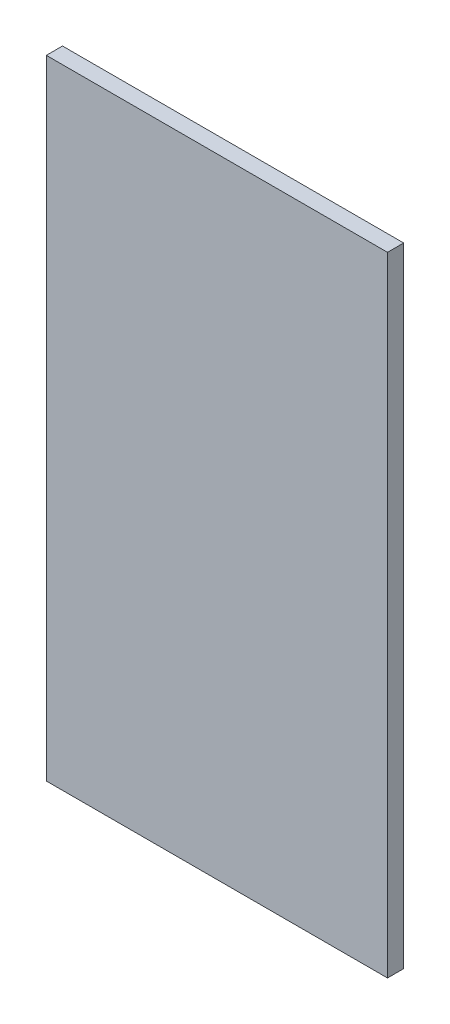
ISO-10303-21;
HEADER;
FILE_DESCRIPTION(('STEP AP214'),'2;1');
FILE_NAME('part.step','',(''),(''),'','','');
FILE_SCHEMA(('AUTOMOTIVE_DESIGN { 1 0 10303 214 1 1 1 1 }'));
ENDSEC;
DATA;
#1=APPLICATION_CONTEXT('core data for automotive mechanical design processes');
#2=APPLICATION_PROTOCOL_DEFINITION('international standard','automotive_design',2000,#1);
#3=PRODUCT_CONTEXT('',#1,'mechanical');
#4=PRODUCT('Part','Part','',(#3));
#5=PRODUCT_RELATED_PRODUCT_CATEGORY('part','',(#4));
#6=PRODUCT_DEFINITION_FORMATION('','',#4);
#7=PRODUCT_DEFINITION_CONTEXT('part definition',#1,'design');
#8=PRODUCT_DEFINITION('design','',#6,#7);
#9=PRODUCT_DEFINITION_SHAPE('','',#8);
#10=(LENGTH_UNIT() NAMED_UNIT(*) SI_UNIT(.MILLI.,.METRE.));
#11=(NAMED_UNIT(*) PLANE_ANGLE_UNIT() SI_UNIT($,.RADIAN.));
#12=(NAMED_UNIT(*) SI_UNIT($,.STERADIAN.) SOLID_ANGLE_UNIT());
#13=UNCERTAINTY_MEASURE_WITH_UNIT(LENGTH_MEASURE(1.E-05),#10,'distance_accuracy_value','');
#14=(GEOMETRIC_REPRESENTATION_CONTEXT(3) GLOBAL_UNCERTAINTY_ASSIGNED_CONTEXT((#13)) GLOBAL_UNIT_ASSIGNED_CONTEXT((#10,
#11,#12)) REPRESENTATION_CONTEXT('',''));
#15=CARTESIAN_POINT('',(0.,0.,0.));
#16=DIRECTION('',(0.,0.,1.));
#17=DIRECTION('',(1.,0.,0.));
#18=AXIS2_PLACEMENT_3D('',#15,#16,#17);
#19=CARTESIAN_POINT('',(-25.3832742935174,-32.4760389532344,18.));
#20=DIRECTION('',(1.,0.,0.));
#21=DIRECTION('',(0.,0.,-1.));
#22=AXIS2_PLACEMENT_3D('',#19,#20,#21);
#23=PLANE('',#22);
#24=DIRECTION('',(0.,-1.,0.));
#25=VECTOR('',#24,1.);
#26=CARTESIAN_POINT('',(-25.3832742935174,-32.4760389532344,0.));
#27=LINE('',#26,#25);
#28=CARTESIAN_POINT('',(-25.3832742935174,667.523961046766,0.));
#29=VERTEX_POINT('',#28);
#30=CARTESIAN_POINT('',(-25.3832742935174,-32.4760389532344,0.));
#31=VERTEX_POINT('',#30);
#32=EDGE_CURVE('E96',#29,#31,#27,.T.);
#33=ORIENTED_EDGE('',*,*,#32,.T.);
#34=DIRECTION('',(0.,0.,-1.));
#35=VECTOR('',#34,1.);
#36=CARTESIAN_POINT('',(-25.3832742935174,-32.4760389532344,18.));
#37=LINE('',#36,#35);
#38=CARTESIAN_POINT('',(-25.3832742935174,-32.4760389532344,18.));
#39=VERTEX_POINT('',#38);
#40=EDGE_CURVE('E11',#39,#31,#37,.T.);
#41=ORIENTED_EDGE('',*,*,#40,.F.);
#42=DIRECTION('',(0.,-1.,0.));
#43=VECTOR('',#42,1.);
#44=CARTESIAN_POINT('',(-25.3832742935174,-32.4760389532344,18.));
#45=LINE('',#44,#43);
#46=CARTESIAN_POINT('',(-25.3832742935174,667.523961046766,18.));
#47=VERTEX_POINT('',#46);
#48=EDGE_CURVE('E84',#47,#39,#45,.T.);
#49=ORIENTED_EDGE('',*,*,#48,.F.);
#50=DIRECTION('',(0.,0.,-1.));
#51=VECTOR('',#50,1.);
#52=CARTESIAN_POINT('',(-25.3832742935174,667.523961046766,18.));
#53=LINE('',#52,#51);
#54=EDGE_CURVE('E92',#47,#29,#53,.T.);
#55=ORIENTED_EDGE('',*,*,#54,.T.);
#56=EDGE_LOOP('',(#33,#41,#49,#55));
#57=FACE_BOUND('',#56,.T.);
#58=ADVANCED_FACE('F33',(#57),#23,.F.);
#59=CARTESIAN_POINT('',(-25.3832742935174,-32.4760389532344,18.));
#60=DIRECTION('',(0.,1.,0.));
#61=DIRECTION('',(0.,0.,1.));
#62=AXIS2_PLACEMENT_3D('',#59,#60,#61);
#63=PLANE('',#62);
#64=DIRECTION('',(1.,0.,0.));
#65=VECTOR('',#64,1.);
#66=CARTESIAN_POINT('',(-25.3832742935174,-32.4760389532344,0.));
#67=LINE('',#66,#65);
#68=CARTESIAN_POINT('',(354.616725706483,-32.4760389532344,0.));
#69=VERTEX_POINT('',#68);
#70=EDGE_CURVE('E88',#31,#69,#67,.T.);
#71=ORIENTED_EDGE('',*,*,#70,.T.);
#72=DIRECTION('',(0.,0.,-1.));
#73=VECTOR('',#72,1.);
#74=CARTESIAN_POINT('',(354.616725706483,-32.4760389532344,18.));
#75=LINE('',#74,#73);
#76=CARTESIAN_POINT('',(354.616725706483,-32.4760389532344,18.));
#77=VERTEX_POINT('',#76);
#78=EDGE_CURVE('E41',#77,#69,#75,.T.);
#79=ORIENTED_EDGE('',*,*,#78,.F.);
#80=DIRECTION('',(1.,0.,0.));
#81=VECTOR('',#80,1.);
#82=CARTESIAN_POINT('',(-25.3832742935174,-32.4760389532344,18.));
#83=LINE('',#82,#81);
#84=EDGE_CURVE('E79',#39,#77,#83,.T.);
#85=ORIENTED_EDGE('',*,*,#84,.F.);
#86=ORIENTED_EDGE('',*,*,#40,.T.);
#87=EDGE_LOOP('',(#71,#79,#85,#86));
#88=FACE_BOUND('',#87,.T.);
#89=ADVANCED_FACE('F87',(#88),#63,.F.);
#90=CARTESIAN_POINT('',(354.616725706483,-32.4760389532344,18.));
#91=DIRECTION('',(-1.,0.,0.));
#92=DIRECTION('',(0.,0.,1.));
#93=AXIS2_PLACEMENT_3D('',#90,#91,#92);
#94=PLANE('',#93);
#95=DIRECTION('',(0.,1.,0.));
#96=VECTOR('',#95,1.);
#97=CARTESIAN_POINT('',(354.616725706483,-32.4760389532344,0.));
#98=LINE('',#97,#96);
#99=CARTESIAN_POINT('',(354.616725706483,667.523961046766,0.));
#100=VERTEX_POINT('',#99);
#101=EDGE_CURVE('E66',#69,#100,#98,.T.);
#102=ORIENTED_EDGE('',*,*,#101,.T.);
#103=DIRECTION('',(0.,0.,-1.));
#104=VECTOR('',#103,1.);
#105=CARTESIAN_POINT('',(354.616725706483,667.523961046766,18.));
#106=LINE('',#105,#104);
#107=CARTESIAN_POINT('',(354.616725706483,667.523961046766,18.));
#108=VERTEX_POINT('',#107);
#109=EDGE_CURVE('E89',#108,#100,#106,.T.);
#110=ORIENTED_EDGE('',*,*,#109,.F.);
#111=DIRECTION('',(0.,1.,0.));
#112=VECTOR('',#111,1.);
#113=CARTESIAN_POINT('',(354.616725706483,-32.4760389532344,18.));
#114=LINE('',#113,#112);
#115=EDGE_CURVE('E82',#77,#108,#114,.T.);
#116=ORIENTED_EDGE('',*,*,#115,.F.);
#117=ORIENTED_EDGE('',*,*,#78,.T.);
#118=EDGE_LOOP('',(#102,#110,#116,#117));
#119=FACE_BOUND('',#118,.T.);
#120=ADVANCED_FACE('F90',(#119),#94,.F.);
#121=CARTESIAN_POINT('',(-25.3832742935174,667.523961046766,18.));
#122=DIRECTION('',(0.,-1.,0.));
#123=DIRECTION('',(0.,0.,-1.));
#124=AXIS2_PLACEMENT_3D('',#121,#122,#123);
#125=PLANE('',#124);
#126=DIRECTION('',(-1.,0.,0.));
#127=VECTOR('',#126,1.);
#128=CARTESIAN_POINT('',(-25.3832742935174,667.523961046766,0.));
#129=LINE('',#128,#127);
#130=EDGE_CURVE('E72',#100,#29,#129,.T.);
#131=ORIENTED_EDGE('',*,*,#130,.T.);
#132=ORIENTED_EDGE('',*,*,#54,.F.);
#133=DIRECTION('',(-1.,0.,0.));
#134=VECTOR('',#133,1.);
#135=CARTESIAN_POINT('',(-25.3832742935174,667.523961046766,18.));
#136=LINE('',#135,#134);
#137=EDGE_CURVE('E49',#108,#47,#136,.T.);
#138=ORIENTED_EDGE('',*,*,#137,.F.);
#139=ORIENTED_EDGE('',*,*,#109,.T.);
#140=EDGE_LOOP('',(#131,#132,#138,#139));
#141=FACE_BOUND('',#140,.T.);
#142=ADVANCED_FACE('F103',(#141),#125,.F.);
#143=CARTESIAN_POINT('',(0.,0.,18.));
#144=DIRECTION('',(0.,0.,-1.));
#145=DIRECTION('',(-1.,0.,0.));
#146=AXIS2_PLACEMENT_3D('',#143,#144,#145);
#147=PLANE('',#146);
#148=ORIENTED_EDGE('',*,*,#48,.T.);
#149=ORIENTED_EDGE('',*,*,#84,.T.);
#150=ORIENTED_EDGE('',*,*,#115,.T.);
#151=ORIENTED_EDGE('',*,*,#137,.T.);
#152=EDGE_LOOP('',(#148,#149,#150,#151));
#153=FACE_BOUND('',#152,.T.);
#154=ADVANCED_FACE('F80',(#153),#147,.F.);
#155=CARTESIAN_POINT('',(0.,0.,0.));
#156=DIRECTION('',(0.,0.,-1.));
#157=DIRECTION('',(-1.,0.,0.));
#158=AXIS2_PLACEMENT_3D('',#155,#156,#157);
#159=PLANE('',#158);
#160=ORIENTED_EDGE('',*,*,#32,.F.);
#161=ORIENTED_EDGE('',*,*,#130,.F.);
#162=ORIENTED_EDGE('',*,*,#101,.F.);
#163=ORIENTED_EDGE('',*,*,#70,.F.);
#164=EDGE_LOOP('',(#160,#161,#162,#163));
#165=FACE_BOUND('',#164,.T.);
#166=ADVANCED_FACE('F106',(#165),#159,.T.);
#167=CLOSED_SHELL('',(#58,#89,#120,#142,#154,#166));
#168=MANIFOLD_SOLID_BREP('B2',#167);
#169=ADVANCED_BREP_SHAPE_REPRESENTATION('',(#18,#168),#14);
#170=SHAPE_DEFINITION_REPRESENTATION(#9,#169);
ENDSEC;
END-ISO-10303-21;
